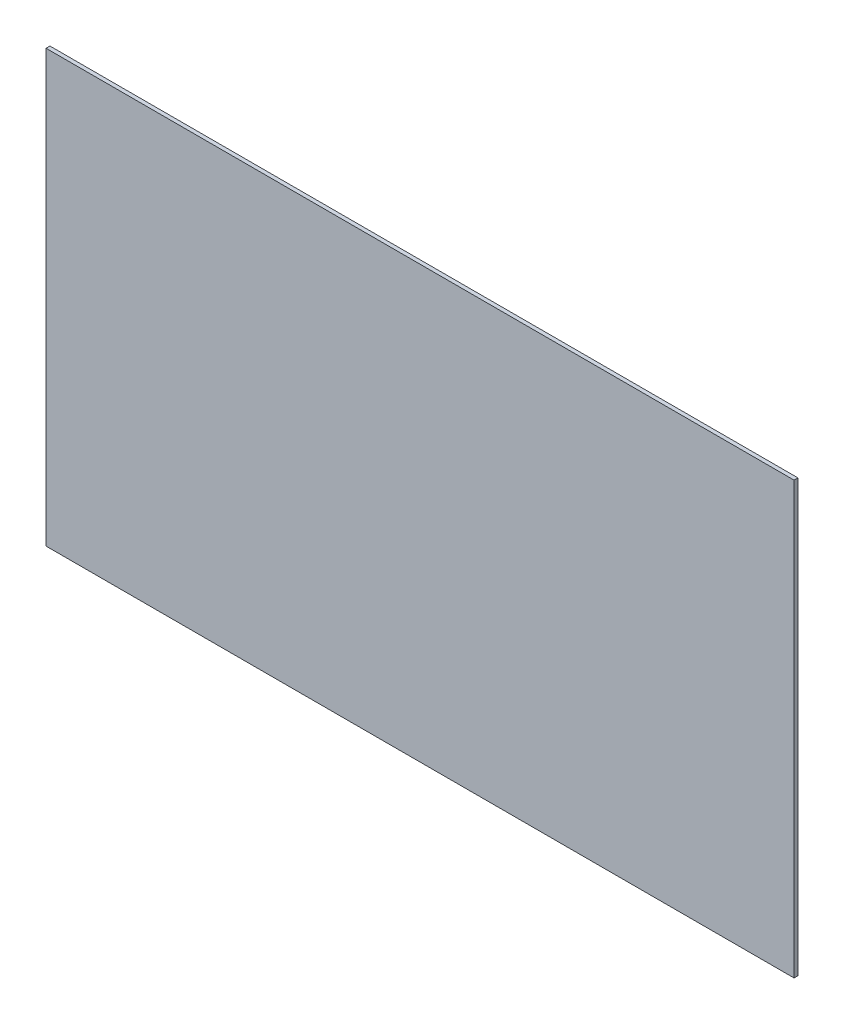
ISO-10303-21;
HEADER;
FILE_DESCRIPTION(('STEP AP214'),'2;1');
FILE_NAME('part.step','',(''),(''),'','','');
FILE_SCHEMA(('AUTOMOTIVE_DESIGN { 1 0 10303 214 1 1 1 1 }'));
ENDSEC;
DATA;
#1=APPLICATION_CONTEXT('core data for automotive mechanical design processes');
#2=APPLICATION_PROTOCOL_DEFINITION('international standard','automotive_design',2000,#1);
#3=PRODUCT_CONTEXT('',#1,'mechanical');
#4=PRODUCT('Part','Part','',(#3));
#5=PRODUCT_RELATED_PRODUCT_CATEGORY('part','',(#4));
#6=PRODUCT_DEFINITION_FORMATION('','',#4);
#7=PRODUCT_DEFINITION_CONTEXT('part definition',#1,'design');
#8=PRODUCT_DEFINITION('design','',#6,#7);
#9=PRODUCT_DEFINITION_SHAPE('','',#8);
#10=(LENGTH_UNIT() NAMED_UNIT(*) SI_UNIT(.MILLI.,.METRE.));
#11=(NAMED_UNIT(*) PLANE_ANGLE_UNIT() SI_UNIT($,.RADIAN.));
#12=(NAMED_UNIT(*) SI_UNIT($,.STERADIAN.) SOLID_ANGLE_UNIT());
#13=UNCERTAINTY_MEASURE_WITH_UNIT(LENGTH_MEASURE(1.E-05),#10,'distance_accuracy_value','');
#14=(GEOMETRIC_REPRESENTATION_CONTEXT(3) GLOBAL_UNCERTAINTY_ASSIGNED_CONTEXT((#13)) GLOBAL_UNIT_ASSIGNED_CONTEXT((#10,
#11,#12)) REPRESENTATION_CONTEXT('',''));
#15=CARTESIAN_POINT('',(0.,0.,0.));
#16=DIRECTION('',(0.,0.,1.));
#17=DIRECTION('',(1.,0.,0.));
#18=AXIS2_PLACEMENT_3D('',#15,#16,#17);
#19=CARTESIAN_POINT('',(0.,0.,9.525));
#20=DIRECTION('',(0.,0.,1.));
#21=DIRECTION('',(1.,0.,0.));
#22=AXIS2_PLACEMENT_3D('',#19,#20,#21);
#23=PLANE('',#22);
#24=DIRECTION('',(0.,1.,0.));
#25=VECTOR('',#24,1.);
#26=CARTESIAN_POINT('',(0.,1054.1,9.525));
#27=LINE('',#26,#25);
#28=CARTESIAN_POINT('',(0.,0.,9.525));
#29=VERTEX_POINT('',#28);
#30=CARTESIAN_POINT('',(0.,1054.1,9.525));
#31=VERTEX_POINT('',#30);
#32=EDGE_CURVE('E68',#29,#31,#27,.T.);
#33=ORIENTED_EDGE('',*,*,#32,.F.);
#34=DIRECTION('',(1.,0.,0.));
#35=VECTOR('',#34,1.);
#36=CARTESIAN_POINT('',(0.,0.,9.525));
#37=LINE('',#36,#35);
#38=CARTESIAN_POINT('',(1828.8,0.,9.525));
#39=VERTEX_POINT('',#38);
#40=EDGE_CURVE('E20',#39,#29,#37,.F.);
#41=ORIENTED_EDGE('',*,*,#40,.F.);
#42=DIRECTION('',(0.,1.,0.));
#43=VECTOR('',#42,1.);
#44=CARTESIAN_POINT('',(1828.8,0.,9.525));
#45=LINE('',#44,#43);
#46=CARTESIAN_POINT('',(1828.8,1054.1,9.525));
#47=VERTEX_POINT('',#46);
#48=EDGE_CURVE('E58',#47,#39,#45,.F.);
#49=ORIENTED_EDGE('',*,*,#48,.F.);
#50=DIRECTION('',(1.,0.,0.));
#51=VECTOR('',#50,1.);
#52=CARTESIAN_POINT('',(1828.8,1054.1,9.525));
#53=LINE('',#52,#51);
#54=EDGE_CURVE('E53',#31,#47,#53,.T.);
#55=ORIENTED_EDGE('',*,*,#54,.F.);
#56=EDGE_LOOP('',(#33,#41,#49,#55));
#57=FACE_BOUND('',#56,.T.);
#58=ADVANCED_FACE('F17',(#57),#23,.T.);
#59=CARTESIAN_POINT('',(0.,0.,0.));
#60=DIRECTION('',(0.,-1.,0.));
#61=DIRECTION('',(0.,0.,-1.));
#62=AXIS2_PLACEMENT_3D('',#59,#60,#61);
#63=PLANE('',#62);
#64=DIRECTION('',(0.,0.,1.));
#65=VECTOR('',#64,1.);
#66=CARTESIAN_POINT('',(0.,0.,0.));
#67=LINE('',#66,#65);
#68=CARTESIAN_POINT('',(0.,0.,0.));
#69=VERTEX_POINT('',#68);
#70=EDGE_CURVE('E79',#69,#29,#67,.T.);
#71=ORIENTED_EDGE('',*,*,#70,.F.);
#72=DIRECTION('',(1.,0.,0.));
#73=VECTOR('',#72,1.);
#74=CARTESIAN_POINT('',(0.,0.,0.));
#75=LINE('',#74,#73);
#76=CARTESIAN_POINT('',(1828.8,0.,0.));
#77=VERTEX_POINT('',#76);
#78=EDGE_CURVE('E74',#69,#77,#75,.T.);
#79=ORIENTED_EDGE('',*,*,#78,.T.);
#80=DIRECTION('',(0.,0.,-1.));
#81=VECTOR('',#80,1.);
#82=CARTESIAN_POINT('',(1828.8,0.,0.));
#83=LINE('',#82,#81);
#84=EDGE_CURVE('E63',#39,#77,#83,.T.);
#85=ORIENTED_EDGE('',*,*,#84,.F.);
#86=ORIENTED_EDGE('',*,*,#40,.T.);
#87=EDGE_LOOP('',(#71,#79,#85,#86));
#88=FACE_BOUND('',#87,.T.);
#89=ADVANCED_FACE('F73',(#88),#63,.T.);
#90=CARTESIAN_POINT('',(1828.8,0.,0.));
#91=DIRECTION('',(1.,0.,0.));
#92=DIRECTION('',(0.,0.,-1.));
#93=AXIS2_PLACEMENT_3D('',#90,#91,#92);
#94=PLANE('',#93);
#95=ORIENTED_EDGE('',*,*,#84,.T.);
#96=DIRECTION('',(0.,1.,0.));
#97=VECTOR('',#96,1.);
#98=CARTESIAN_POINT('',(1828.8,0.,0.));
#99=LINE('',#98,#97);
#100=CARTESIAN_POINT('',(1828.8,1054.1,0.));
#101=VERTEX_POINT('',#100);
#102=EDGE_CURVE('E84',#77,#101,#99,.T.);
#103=ORIENTED_EDGE('',*,*,#102,.T.);
#104=DIRECTION('',(0.,0.,1.));
#105=VECTOR('',#104,1.);
#106=CARTESIAN_POINT('',(1828.8,1054.1,0.));
#107=LINE('',#106,#105);
#108=EDGE_CURVE('E65',#47,#101,#107,.F.);
#109=ORIENTED_EDGE('',*,*,#108,.F.);
#110=ORIENTED_EDGE('',*,*,#48,.T.);
#111=EDGE_LOOP('',(#95,#103,#109,#110));
#112=FACE_BOUND('',#111,.T.);
#113=ADVANCED_FACE('F60',(#112),#94,.T.);
#114=CARTESIAN_POINT('',(1828.8,1054.1,0.));
#115=DIRECTION('',(0.,1.,0.));
#116=DIRECTION('',(0.,0.,1.));
#117=AXIS2_PLACEMENT_3D('',#114,#115,#116);
#118=PLANE('',#117);
#119=ORIENTED_EDGE('',*,*,#108,.T.);
#120=DIRECTION('',(1.,0.,0.));
#121=VECTOR('',#120,1.);
#122=CARTESIAN_POINT('',(0.,1054.1,0.));
#123=LINE('',#122,#121);
#124=CARTESIAN_POINT('',(0.,1054.1,0.));
#125=VERTEX_POINT('',#124);
#126=EDGE_CURVE('E26',#101,#125,#123,.F.);
#127=ORIENTED_EDGE('',*,*,#126,.T.);
#128=DIRECTION('',(0.,0.,1.));
#129=VECTOR('',#128,1.);
#130=CARTESIAN_POINT('',(0.,1054.1,0.));
#131=LINE('',#130,#129);
#132=EDGE_CURVE('E34',#31,#125,#131,.F.);
#133=ORIENTED_EDGE('',*,*,#132,.F.);
#134=ORIENTED_EDGE('',*,*,#54,.T.);
#135=EDGE_LOOP('',(#119,#127,#133,#134));
#136=FACE_BOUND('',#135,.T.);
#137=ADVANCED_FACE('F88',(#136),#118,.T.);
#138=CARTESIAN_POINT('',(0.,1054.1,0.));
#139=DIRECTION('',(-1.,0.,0.));
#140=DIRECTION('',(0.,0.,1.));
#141=AXIS2_PLACEMENT_3D('',#138,#139,#140);
#142=PLANE('',#141);
#143=ORIENTED_EDGE('',*,*,#132,.T.);
#144=DIRECTION('',(0.,1.,0.));
#145=VECTOR('',#144,1.);
#146=CARTESIAN_POINT('',(0.,0.,0.));
#147=LINE('',#146,#145);
#148=EDGE_CURVE('E11',#125,#69,#147,.F.);
#149=ORIENTED_EDGE('',*,*,#148,.T.);
#150=ORIENTED_EDGE('',*,*,#70,.T.);
#151=ORIENTED_EDGE('',*,*,#32,.T.);
#152=EDGE_LOOP('',(#143,#149,#150,#151));
#153=FACE_BOUND('',#152,.T.);
#154=ADVANCED_FACE('F91',(#153),#142,.T.);
#155=CARTESIAN_POINT('',(0.,0.,0.));
#156=DIRECTION('',(0.,0.,1.));
#157=DIRECTION('',(1.,0.,0.));
#158=AXIS2_PLACEMENT_3D('',#155,#156,#157);
#159=PLANE('',#158);
#160=ORIENTED_EDGE('',*,*,#126,.F.);
#161=ORIENTED_EDGE('',*,*,#102,.F.);
#162=ORIENTED_EDGE('',*,*,#78,.F.);
#163=ORIENTED_EDGE('',*,*,#148,.F.);
#164=EDGE_LOOP('',(#160,#161,#162,#163));
#165=FACE_BOUND('',#164,.T.);
#166=ADVANCED_FACE('F90',(#165),#159,.F.);
#167=CLOSED_SHELL('',(#58,#89,#113,#137,#154,#166));
#168=MANIFOLD_SOLID_BREP('B1',#167);
#169=ADVANCED_BREP_SHAPE_REPRESENTATION('',(#18,#168),#14);
#170=SHAPE_DEFINITION_REPRESENTATION(#9,#169);
ENDSEC;
END-ISO-10303-21;
